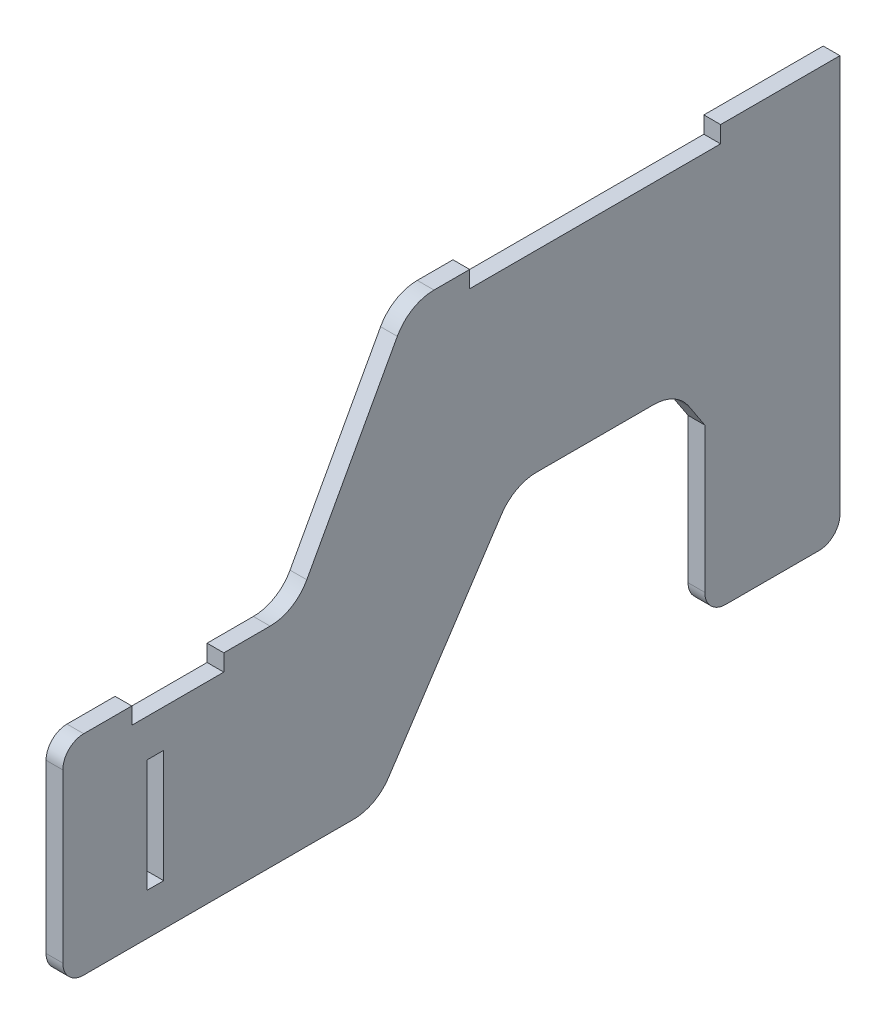
ISO-10303-21;
HEADER;
FILE_DESCRIPTION(('STEP AP214'),'2;1');
FILE_NAME('part.step','',(''),(''),'','','');
FILE_SCHEMA(('AUTOMOTIVE_DESIGN { 1 0 10303 214 1 1 1 1 }'));
ENDSEC;
DATA;
#1=APPLICATION_CONTEXT('core data for automotive mechanical design processes');
#2=APPLICATION_PROTOCOL_DEFINITION('international standard','automotive_design',2000,#1);
#3=PRODUCT_CONTEXT('',#1,'mechanical');
#4=PRODUCT('Part','Part','',(#3));
#5=PRODUCT_RELATED_PRODUCT_CATEGORY('part','',(#4));
#6=PRODUCT_DEFINITION_FORMATION('','',#4);
#7=PRODUCT_DEFINITION_CONTEXT('part definition',#1,'design');
#8=PRODUCT_DEFINITION('design','',#6,#7);
#9=PRODUCT_DEFINITION_SHAPE('','',#8);
#10=(LENGTH_UNIT() NAMED_UNIT(*) SI_UNIT(.MILLI.,.METRE.));
#11=(NAMED_UNIT(*) PLANE_ANGLE_UNIT() SI_UNIT($,.RADIAN.));
#12=(NAMED_UNIT(*) SI_UNIT($,.STERADIAN.) SOLID_ANGLE_UNIT());
#13=UNCERTAINTY_MEASURE_WITH_UNIT(LENGTH_MEASURE(1.E-05),#10,'distance_accuracy_value','');
#14=(GEOMETRIC_REPRESENTATION_CONTEXT(3) GLOBAL_UNCERTAINTY_ASSIGNED_CONTEXT((#13)) GLOBAL_UNIT_ASSIGNED_CONTEXT((#10,
#11,#12)) REPRESENTATION_CONTEXT('',''));
#15=CARTESIAN_POINT('',(0.,0.,0.));
#16=DIRECTION('',(0.,0.,1.));
#17=DIRECTION('',(1.,0.,0.));
#18=AXIS2_PLACEMENT_3D('',#15,#16,#17);
#19=CARTESIAN_POINT('',(4.,-136.204042198668,-171.684730912412));
#20=DIRECTION('',(0.,0.55017201591619,-0.835051347464762));
#21=DIRECTION('',(0.,0.835051347464762,0.55017201591619));
#22=AXIS2_PLACEMENT_3D('',#19,#20,#21);
#23=PLANE('',#22);
#24=DIRECTION('',(-1.,0.,0.));
#25=VECTOR('',#24,1.);
#26=CARTESIAN_POINT('',(4.,-101.052198369376,-148.525004457927));
#27=LINE('',#26,#25);
#28=CARTESIAN_POINT('',(4.,-101.052198369376,-148.525004457927));
#29=VERTEX_POINT('',#28);
#30=CARTESIAN_POINT('',(0.,-101.052198369376,-148.525004457927));
#31=VERTEX_POINT('',#30);
#32=EDGE_CURVE('E263',#29,#31,#27,.T.);
#33=ORIENTED_EDGE('',*,*,#32,.F.);
#34=DIRECTION('',(0.,-0.835051347464762,-0.55017201591619));
#35=VECTOR('',#34,1.);
#36=CARTESIAN_POINT('',(4.,-136.204042198668,-171.684730912412));
#37=LINE('',#36,#35);
#38=CARTESIAN_POINT('',(4.,-95.2006018803445,-144.66969107334));
#39=VERTEX_POINT('',#38);
#40=EDGE_CURVE('E277',#39,#29,#37,.T.);
#41=ORIENTED_EDGE('',*,*,#40,.F.);
#42=DIRECTION('',(-1.,0.,0.));
#43=VECTOR('',#42,1.);
#44=CARTESIAN_POINT('',(4.,-95.2006018803445,-144.66969107334));
#45=LINE('',#44,#43);
#46=CARTESIAN_POINT('',(0.,-95.2006018803445,-144.66969107334));
#47=VERTEX_POINT('',#46);
#48=EDGE_CURVE('E402',#39,#47,#45,.T.);
#49=ORIENTED_EDGE('',*,*,#48,.T.);
#50=DIRECTION('',(0.,-0.835051347464762,-0.55017201591619));
#51=VECTOR('',#50,1.);
#52=CARTESIAN_POINT('',(0.,-136.204042198668,-171.684730912412));
#53=LINE('',#52,#51);
#54=EDGE_CURVE('E279',#47,#31,#53,.T.);
#55=ORIENTED_EDGE('',*,*,#54,.T.);
#56=EDGE_LOOP('',(#33,#41,#49,#55));
#57=FACE_BOUND('',#56,.T.);
#58=ADVANCED_FACE('F48',(#57),#23,.F.);
#59=CARTESIAN_POINT('',(4.,-50.7023220395064,-83.7618124476445));
#60=DIRECTION('',(-1.,0.,0.));
#61=DIRECTION('',(0.,0.,1.));
#62=AXIS2_PLACEMENT_3D('',#59,#60,#61);
#63=PLANE('',#62);
#64=DIRECTION('',(0.,1.,0.));
#65=VECTOR('',#64,1.);
#66=CARTESIAN_POINT('',(4.,-40.7023220395064,-180.831194294369));
#67=LINE('',#66,#65);
#68=CARTESIAN_POINT('',(4.,-135.702322039506,-180.831194294369));
#69=VERTEX_POINT('',#68);
#70=CARTESIAN_POINT('',(4.,-40.7023220395064,-180.831194294369));
#71=VERTEX_POINT('',#70);
#72=EDGE_CURVE('E543',#69,#71,#67,.T.);
#73=ORIENTED_EDGE('',*,*,#72,.T.);
#74=DIRECTION('',(0.,0.,1.));
#75=VECTOR('',#74,1.);
#76=CARTESIAN_POINT('',(4.,-40.7023220395064,-152.296503371007));
#77=LINE('',#76,#75);
#78=CARTESIAN_POINT('',(4.,-40.7023220395064,-152.296503371007));
#79=VERTEX_POINT('',#78);
#80=EDGE_CURVE('E289',#71,#79,#77,.T.);
#81=ORIENTED_EDGE('',*,*,#80,.T.);
#82=DIRECTION('',(0.,-1.,0.));
#83=VECTOR('',#82,1.);
#84=CARTESIAN_POINT('',(4.,-40.7023220395064,-152.296503371007));
#85=LINE('',#84,#83);
#86=CARTESIAN_POINT('',(4.,-44.7023220395064,-152.296503371007));
#87=VERTEX_POINT('',#86);
#88=EDGE_CURVE('E293',#79,#87,#85,.T.);
#89=ORIENTED_EDGE('',*,*,#88,.T.);
#90=DIRECTION('',(0.,0.,1.));
#91=VECTOR('',#90,1.);
#92=CARTESIAN_POINT('',(4.,-44.7023220395064,-92.2965033710069));
#93=LINE('',#92,#91);
#94=CARTESIAN_POINT('',(4.,-44.7023220395064,-92.2965033710069));
#95=VERTEX_POINT('',#94);
#96=EDGE_CURVE('E301',#87,#95,#93,.T.);
#97=ORIENTED_EDGE('',*,*,#96,.T.);
#98=DIRECTION('',(0.,1.,0.));
#99=VECTOR('',#98,1.);
#100=CARTESIAN_POINT('',(4.,-40.7023220395064,-92.2965033710069));
#101=LINE('',#100,#99);
#102=CARTESIAN_POINT('',(4.,-40.7023220395064,-92.2965033710069));
#103=VERTEX_POINT('',#102);
#104=EDGE_CURVE('E304',#95,#103,#101,.T.);
#105=ORIENTED_EDGE('',*,*,#104,.T.);
#106=DIRECTION('',(0.,0.,1.));
#107=VECTOR('',#106,1.);
#108=CARTESIAN_POINT('',(4.,-40.7023220395064,-83.7618124476445));
#109=LINE('',#108,#107);
#110=CARTESIAN_POINT('',(4.,-40.7023220395064,-83.7618124476445));
#111=VERTEX_POINT('',#110);
#112=EDGE_CURVE('E307',#103,#111,#109,.T.);
#113=ORIENTED_EDGE('',*,*,#112,.T.);
#114=CARTESIAN_POINT('',(4.,-50.7023220395064,-83.7618124476445));
#115=DIRECTION('',(1.,0.,0.));
#116=DIRECTION('',(0.,0.,1.));
#117=AXIS2_PLACEMENT_3D('',#114,#115,#116);
#118=CIRCLE('',#117,10.);
#119=CARTESIAN_POINT('',(4.,-45.9058680357739,-74.9871882967148));
#120=VERTEX_POINT('',#119);
#121=EDGE_CURVE('E382',#111,#120,#118,.T.);
#122=ORIENTED_EDGE('',*,*,#121,.T.);
#123=DIRECTION('',(0.,-0.877462415092971,0.479645400373245));
#124=VECTOR('',#123,1.);
#125=CARTESIAN_POINT('',(4.,-85.4987760432388,-53.344601803515));
#126=LINE('',#125,#124);
#127=CARTESIAN_POINT('',(4.,-85.4987760432388,-53.344601803515));
#128=VERTEX_POINT('',#127);
#129=EDGE_CURVE('E611',#120,#128,#126,.T.);
#130=ORIENTED_EDGE('',*,*,#129,.T.);
#131=CARTESIAN_POINT('',(4.,-80.7023220395064,-44.5699776525853));
#132=DIRECTION('',(-1.,0.,0.));
#133=DIRECTION('',(0.,0.,-1.));
#134=AXIS2_PLACEMENT_3D('',#131,#132,#133);
#135=CIRCLE('',#134,10.);
#136=CARTESIAN_POINT('',(4.,-90.7023220395064,-44.5699776525853));
#137=VERTEX_POINT('',#136);
#138=EDGE_CURVE('E468',#128,#137,#135,.T.);
#139=ORIENTED_EDGE('',*,*,#138,.T.);
#140=DIRECTION('',(0.,0.,1.));
#141=VECTOR('',#140,1.);
#142=CARTESIAN_POINT('',(4.,-90.7023220395064,-38.5350881272695));
#143=LINE('',#142,#141);
#144=CARTESIAN_POINT('',(4.,-90.7023220395064,-33.5001986019536));
#145=VERTEX_POINT('',#144);
#146=EDGE_CURVE('E488',#137,#145,#143,.T.);
#147=ORIENTED_EDGE('',*,*,#146,.T.);
#148=DIRECTION('',(0.,-1.,0.));
#149=VECTOR('',#148,1.);
#150=CARTESIAN_POINT('',(4.,-94.7023220395064,-33.5001986019536));
#151=LINE('',#150,#149);
#152=CARTESIAN_POINT('',(4.,-94.7023220395064,-33.5001986019536));
#153=VERTEX_POINT('',#152);
#154=EDGE_CURVE('E484',#145,#153,#151,.T.);
#155=ORIENTED_EDGE('',*,*,#154,.T.);
#156=DIRECTION('',(0.,0.,1.));
#157=VECTOR('',#156,1.);
#158=CARTESIAN_POINT('',(4.,-94.7023220395064,-11.5001986019536));
#159=LINE('',#158,#157);
#160=CARTESIAN_POINT('',(4.,-94.7023220395064,-11.5001986019536));
#161=VERTEX_POINT('',#160);
#162=EDGE_CURVE('E487',#153,#161,#159,.T.);
#163=ORIENTED_EDGE('',*,*,#162,.T.);
#164=DIRECTION('',(0.,1.,0.));
#165=VECTOR('',#164,1.);
#166=CARTESIAN_POINT('',(4.,-90.7023220395064,-11.5001986019536));
#167=LINE('',#166,#165);
#168=CARTESIAN_POINT('',(4.,-90.7023220395064,-11.5001986019536));
#169=VERTEX_POINT('',#168);
#170=EDGE_CURVE('E492',#161,#169,#167,.T.);
#171=ORIENTED_EDGE('',*,*,#170,.T.);
#172=DIRECTION('',(0.,0.,1.));
#173=VECTOR('',#172,1.);
#174=CARTESIAN_POINT('',(4.,-90.7023220395064,0.));
#175=LINE('',#174,#173);
#176=CARTESIAN_POINT('',(4.,-90.7023220395064,0.));
#177=VERTEX_POINT('',#176);
#178=EDGE_CURVE('E499',#169,#177,#175,.T.);
#179=ORIENTED_EDGE('',*,*,#178,.T.);
#180=CARTESIAN_POINT('',(4.,-95.7023220395064,0.));
#181=DIRECTION('',(1.,0.,0.));
#182=DIRECTION('',(0.,0.,1.));
#183=AXIS2_PLACEMENT_3D('',#180,#181,#182);
#184=CIRCLE('',#183,5.);
#185=CARTESIAN_POINT('',(4.,-95.7023220395064,5.));
#186=VERTEX_POINT('',#185);
#187=EDGE_CURVE('E502',#177,#186,#184,.T.);
#188=ORIENTED_EDGE('',*,*,#187,.T.);
#189=DIRECTION('',(0.,-1.,0.));
#190=VECTOR('',#189,1.);
#191=CARTESIAN_POINT('',(4.,-95.7023220395064,5.));
#192=LINE('',#191,#190);
#193=CARTESIAN_POINT('',(4.,-135.702322039506,5.));
#194=VERTEX_POINT('',#193);
#195=EDGE_CURVE('E505',#186,#194,#192,.T.);
#196=ORIENTED_EDGE('',*,*,#195,.T.);
#197=CARTESIAN_POINT('',(4.,-135.702322039506,0.));
#198=DIRECTION('',(1.,0.,0.));
#199=DIRECTION('',(0.,0.,-1.));
#200=AXIS2_PLACEMENT_3D('',#197,#198,#199);
#201=CIRCLE('',#200,5.);
#202=CARTESIAN_POINT('',(4.,-140.702322039506,0.));
#203=VERTEX_POINT('',#202);
#204=EDGE_CURVE('E508',#194,#203,#201,.T.);
#205=ORIENTED_EDGE('',*,*,#204,.T.);
#206=DIRECTION('',(0.,0.,-1.));
#207=VECTOR('',#206,1.);
#208=CARTESIAN_POINT('',(4.,-140.702322039506,0.));
#209=LINE('',#208,#207);
#210=CARTESIAN_POINT('',(4.,-140.702322039506,-64.5577623549545));
#211=VERTEX_POINT('',#210);
#212=EDGE_CURVE('E511',#203,#211,#209,.T.);
#213=ORIENTED_EDGE('',*,*,#212,.T.);
#214=CARTESIAN_POINT('',(4.,-130.702322039506,-64.5577623549545));
#215=DIRECTION('',(1.,0.,0.));
#216=DIRECTION('',(0.,0.,1.));
#217=AXIS2_PLACEMENT_3D('',#214,#215,#216);
#218=CIRCLE('',#217,10.);
#219=CARTESIAN_POINT('',(4.,-136.204042198668,-72.9082758296021));
#220=VERTEX_POINT('',#219);
#221=EDGE_CURVE('E514',#211,#220,#218,.T.);
#222=ORIENTED_EDGE('',*,*,#221,.T.);
#223=DIRECTION('',(0.,0.835051347464763,-0.55017201591619));
#224=VECTOR('',#223,1.);
#225=CARTESIAN_POINT('',(4.,-136.204042198668,-72.9082758296021));
#226=LINE('',#225,#224);
#227=CARTESIAN_POINT('',(4.,-95.2006018803445,-99.9233156686742));
#228=VERTEX_POINT('',#227);
#229=EDGE_CURVE('E517',#220,#228,#226,.T.);
#230=ORIENTED_EDGE('',*,*,#229,.T.);
#231=CARTESIAN_POINT('',(4.,-100.702322039506,-108.273829143322));
#232=DIRECTION('',(-1.,0.,0.));
#233=DIRECTION('',(0.,0.,1.));
#234=AXIS2_PLACEMENT_3D('',#231,#232,#233);
#235=CIRCLE('',#234,10.);
#236=CARTESIAN_POINT('',(4.,-90.7023220395064,-108.273829143322));
#237=VERTEX_POINT('',#236);
#238=EDGE_CURVE('E520',#228,#237,#235,.T.);
#239=ORIENTED_EDGE('',*,*,#238,.T.);
#240=DIRECTION('',(0.,0.,-1.));
#241=VECTOR('',#240,1.);
#242=CARTESIAN_POINT('',(4.,-90.7023220395064,-136.319177598692));
#243=LINE('',#242,#241);
#244=CARTESIAN_POINT('',(4.,-90.7023220395064,-136.319177598692));
#245=VERTEX_POINT('',#244);
#246=EDGE_CURVE('E295',#237,#245,#243,.T.);
#247=ORIENTED_EDGE('',*,*,#246,.T.);
#248=CARTESIAN_POINT('',(4.,-100.702322039506,-136.319177598692));
#249=DIRECTION('',(-1.,0.,0.));
#250=DIRECTION('',(0.,0.,-1.));
#251=AXIS2_PLACEMENT_3D('',#248,#249,#250);
#252=CIRCLE('',#251,10.);
#253=EDGE_CURVE('E286',#245,#39,#252,.T.);
#254=ORIENTED_EDGE('',*,*,#253,.T.);
#255=ORIENTED_EDGE('',*,*,#40,.T.);
#256=DIRECTION('',(0.,-1.,0.));
#257=VECTOR('',#256,1.);
#258=CARTESIAN_POINT('',(4.,-101.052198369376,-148.525004457927));
#259=LINE('',#258,#257);
#260=CARTESIAN_POINT('',(4.,-135.702322039506,-148.525004457927));
#261=VERTEX_POINT('',#260);
#262=EDGE_CURVE('E260',#29,#261,#259,.T.);
#263=ORIENTED_EDGE('',*,*,#262,.T.);
#264=CARTESIAN_POINT('',(4.,-135.702322039506,-153.525004457927));
#265=DIRECTION('',(1.,0.,0.));
#266=DIRECTION('',(0.,0.,-1.));
#267=AXIS2_PLACEMENT_3D('',#264,#265,#266);
#268=CIRCLE('',#267,5.);
#269=CARTESIAN_POINT('',(4.,-140.702322039506,-153.525004457927));
#270=VERTEX_POINT('',#269);
#271=EDGE_CURVE('E271',#261,#270,#268,.T.);
#272=ORIENTED_EDGE('',*,*,#271,.T.);
#273=DIRECTION('',(0.,0.,-1.));
#274=VECTOR('',#273,1.);
#275=CARTESIAN_POINT('',(4.,-140.702322039506,-153.525004457927));
#276=LINE('',#275,#274);
#277=CARTESIAN_POINT('',(4.,-140.702322039506,-175.831194294369));
#278=VERTEX_POINT('',#277);
#279=EDGE_CURVE('E656',#270,#278,#276,.T.);
#280=ORIENTED_EDGE('',*,*,#279,.T.);
#281=CARTESIAN_POINT('',(4.,-135.702322039506,-175.831194294369));
#282=DIRECTION('',(1.,0.,0.));
#283=DIRECTION('',(0.,0.,-1.));
#284=AXIS2_PLACEMENT_3D('',#281,#282,#283);
#285=CIRCLE('',#284,5.);
#286=EDGE_CURVE('E652',#278,#69,#285,.T.);
#287=ORIENTED_EDGE('',*,*,#286,.T.);
#288=EDGE_LOOP('',(#73,#81,#89,#97,#105,#113,#122,#130,#139,#147,#155,#163,#171,#179,#188,#196,
#205,#213,#222,#230,#239,#247,#254,#255,#263,#272,#280,#287));
#289=FACE_BOUND('',#288,.T.);
#290=DIRECTION('',(0.,1.,0.));
#291=VECTOR('',#290,1.);
#292=CARTESIAN_POINT('',(4.,-103.702322039506,-19.13));
#293=LINE('',#292,#291);
#294=CARTESIAN_POINT('',(4.,-130.702322039506,-19.13));
#295=VERTEX_POINT('',#294);
#296=CARTESIAN_POINT('',(4.,-103.702322039506,-19.13));
#297=VERTEX_POINT('',#296);
#298=EDGE_CURVE('E572',#295,#297,#293,.T.);
#299=ORIENTED_EDGE('',*,*,#298,.F.);
#300=DIRECTION('',(0.,0.,-1.));
#301=VECTOR('',#300,1.);
#302=CARTESIAN_POINT('',(4.,-130.702322039506,-19.13));
#303=LINE('',#302,#301);
#304=CARTESIAN_POINT('',(4.,-130.702322039506,-15.13));
#305=VERTEX_POINT('',#304);
#306=EDGE_CURVE('E582',#305,#295,#303,.T.);
#307=ORIENTED_EDGE('',*,*,#306,.F.);
#308=DIRECTION('',(0.,-1.,0.));
#309=VECTOR('',#308,1.);
#310=CARTESIAN_POINT('',(4.,-103.702322039506,-15.13));
#311=LINE('',#310,#309);
#312=CARTESIAN_POINT('',(4.,-103.702322039506,-15.13));
#313=VERTEX_POINT('',#312);
#314=EDGE_CURVE('E579',#313,#305,#311,.T.);
#315=ORIENTED_EDGE('',*,*,#314,.F.);
#316=DIRECTION('',(0.,0.,1.));
#317=VECTOR('',#316,1.);
#318=CARTESIAN_POINT('',(4.,-103.702322039506,-19.13));
#319=LINE('',#318,#317);
#320=EDGE_CURVE('E575',#297,#313,#319,.T.);
#321=ORIENTED_EDGE('',*,*,#320,.F.);
#322=EDGE_LOOP('',(#299,#307,#315,#321));
#323=FACE_BOUND('',#322,.T.);
#324=ADVANCED_FACE('F283',(#289,#323),#63,.F.);
#325=CARTESIAN_POINT('',(0.,-50.7023220395064,-83.7618124476445));
#326=DIRECTION('',(-1.,0.,0.));
#327=DIRECTION('',(0.,0.,1.));
#328=AXIS2_PLACEMENT_3D('',#325,#326,#327);
#329=PLANE('',#328);
#330=DIRECTION('',(0.,-1.,0.));
#331=VECTOR('',#330,1.);
#332=CARTESIAN_POINT('',(0.,-101.052198369376,-148.525004457927));
#333=LINE('',#332,#331);
#334=CARTESIAN_POINT('',(0.,-135.702322039506,-148.525004457927));
#335=VERTEX_POINT('',#334);
#336=EDGE_CURVE('E534',#31,#335,#333,.T.);
#337=ORIENTED_EDGE('',*,*,#336,.F.);
#338=ORIENTED_EDGE('',*,*,#54,.F.);
#339=CARTESIAN_POINT('',(0.,-100.702322039506,-136.319177598692));
#340=DIRECTION('',(-1.,0.,0.));
#341=DIRECTION('',(0.,0.,-1.));
#342=AXIS2_PLACEMENT_3D('',#339,#340,#341);
#343=CIRCLE('',#342,10.);
#344=CARTESIAN_POINT('',(0.,-90.7023220395064,-136.319177598692));
#345=VERTEX_POINT('',#344);
#346=EDGE_CURVE('E362',#345,#47,#343,.T.);
#347=ORIENTED_EDGE('',*,*,#346,.F.);
#348=DIRECTION('',(0.,0.,-1.));
#349=VECTOR('',#348,1.);
#350=CARTESIAN_POINT('',(0.,-90.7023220395064,-136.319177598692));
#351=LINE('',#350,#349);
#352=CARTESIAN_POINT('',(0.,-90.7023220395064,-108.273829143322));
#353=VERTEX_POINT('',#352);
#354=EDGE_CURVE('E359',#353,#345,#351,.T.);
#355=ORIENTED_EDGE('',*,*,#354,.F.);
#356=CARTESIAN_POINT('',(0.,-100.702322039506,-108.273829143322));
#357=DIRECTION('',(-1.,0.,0.));
#358=DIRECTION('',(0.,0.,1.));
#359=AXIS2_PLACEMENT_3D('',#356,#357,#358);
#360=CIRCLE('',#359,10.);
#361=CARTESIAN_POINT('',(0.,-95.2006018803445,-99.9233156686742));
#362=VERTEX_POINT('',#361);
#363=EDGE_CURVE('E356',#362,#353,#360,.T.);
#364=ORIENTED_EDGE('',*,*,#363,.F.);
#365=DIRECTION('',(0.,0.835051347464763,-0.55017201591619));
#366=VECTOR('',#365,1.);
#367=CARTESIAN_POINT('',(0.,-136.204042198668,-72.9082758296021));
#368=LINE('',#367,#366);
#369=CARTESIAN_POINT('',(0.,-136.204042198668,-72.9082758296021));
#370=VERTEX_POINT('',#369);
#371=EDGE_CURVE('E353',#370,#362,#368,.T.);
#372=ORIENTED_EDGE('',*,*,#371,.F.);
#373=CARTESIAN_POINT('',(0.,-130.702322039506,-64.5577623549545));
#374=DIRECTION('',(1.,0.,0.));
#375=DIRECTION('',(0.,0.,1.));
#376=AXIS2_PLACEMENT_3D('',#373,#374,#375);
#377=CIRCLE('',#376,10.);
#378=CARTESIAN_POINT('',(0.,-140.702322039506,-64.5577623549545));
#379=VERTEX_POINT('',#378);
#380=EDGE_CURVE('E350',#379,#370,#377,.T.);
#381=ORIENTED_EDGE('',*,*,#380,.F.);
#382=DIRECTION('',(0.,0.,-1.));
#383=VECTOR('',#382,1.);
#384=CARTESIAN_POINT('',(0.,-140.702322039506,0.));
#385=LINE('',#384,#383);
#386=CARTESIAN_POINT('',(0.,-140.702322039506,0.));
#387=VERTEX_POINT('',#386);
#388=EDGE_CURVE('E347',#387,#379,#385,.T.);
#389=ORIENTED_EDGE('',*,*,#388,.F.);
#390=CARTESIAN_POINT('',(0.,-135.702322039506,0.));
#391=DIRECTION('',(1.,0.,0.));
#392=DIRECTION('',(0.,0.,-1.));
#393=AXIS2_PLACEMENT_3D('',#390,#391,#392);
#394=CIRCLE('',#393,5.);
#395=CARTESIAN_POINT('',(0.,-135.702322039506,5.));
#396=VERTEX_POINT('',#395);
#397=EDGE_CURVE('E344',#396,#387,#394,.T.);
#398=ORIENTED_EDGE('',*,*,#397,.F.);
#399=DIRECTION('',(0.,-1.,0.));
#400=VECTOR('',#399,1.);
#401=CARTESIAN_POINT('',(0.,-95.7023220395064,5.));
#402=LINE('',#401,#400);
#403=CARTESIAN_POINT('',(0.,-95.7023220395064,5.));
#404=VERTEX_POINT('',#403);
#405=EDGE_CURVE('E341',#404,#396,#402,.T.);
#406=ORIENTED_EDGE('',*,*,#405,.F.);
#407=CARTESIAN_POINT('',(0.,-95.7023220395064,0.));
#408=DIRECTION('',(1.,0.,0.));
#409=DIRECTION('',(0.,0.,1.));
#410=AXIS2_PLACEMENT_3D('',#407,#408,#409);
#411=CIRCLE('',#410,5.);
#412=CARTESIAN_POINT('',(0.,-90.7023220395064,0.));
#413=VERTEX_POINT('',#412);
#414=EDGE_CURVE('E338',#413,#404,#411,.T.);
#415=ORIENTED_EDGE('',*,*,#414,.F.);
#416=DIRECTION('',(0.,0.,1.));
#417=VECTOR('',#416,1.);
#418=CARTESIAN_POINT('',(0.,-90.7023220395064,0.));
#419=LINE('',#418,#417);
#420=CARTESIAN_POINT('',(0.,-90.7023220395064,-11.5001986019536));
#421=VERTEX_POINT('',#420);
#422=EDGE_CURVE('E335',#421,#413,#419,.T.);
#423=ORIENTED_EDGE('',*,*,#422,.F.);
#424=DIRECTION('',(0.,1.,0.));
#425=VECTOR('',#424,1.);
#426=CARTESIAN_POINT('',(0.,-90.7023220395064,-11.5001986019536));
#427=LINE('',#426,#425);
#428=CARTESIAN_POINT('',(0.,-94.7023220395064,-11.5001986019536));
#429=VERTEX_POINT('',#428);
#430=EDGE_CURVE('E332',#429,#421,#427,.T.);
#431=ORIENTED_EDGE('',*,*,#430,.F.);
#432=DIRECTION('',(0.,0.,1.));
#433=VECTOR('',#432,1.);
#434=CARTESIAN_POINT('',(0.,-94.7023220395064,-11.5001986019536));
#435=LINE('',#434,#433);
#436=CARTESIAN_POINT('',(0.,-94.7023220395064,-33.5001986019536));
#437=VERTEX_POINT('',#436);
#438=EDGE_CURVE('E329',#437,#429,#435,.T.);
#439=ORIENTED_EDGE('',*,*,#438,.F.);
#440=DIRECTION('',(0.,-1.,0.));
#441=VECTOR('',#440,1.);
#442=CARTESIAN_POINT('',(0.,-94.7023220395064,-33.5001986019536));
#443=LINE('',#442,#441);
#444=CARTESIAN_POINT('',(0.,-90.7023220395064,-33.5001986019536));
#445=VERTEX_POINT('',#444);
#446=EDGE_CURVE('E326',#445,#437,#443,.T.);
#447=ORIENTED_EDGE('',*,*,#446,.F.);
#448=DIRECTION('',(0.,0.,1.));
#449=VECTOR('',#448,1.);
#450=CARTESIAN_POINT('',(0.,-90.7023220395064,-33.5001986019536));
#451=LINE('',#450,#449);
#452=CARTESIAN_POINT('',(0.,-90.7023220395064,-44.5699776525853));
#453=VERTEX_POINT('',#452);
#454=EDGE_CURVE('E323',#453,#445,#451,.T.);
#455=ORIENTED_EDGE('',*,*,#454,.F.);
#456=CARTESIAN_POINT('',(0.,-80.7023220395064,-44.5699776525853));
#457=DIRECTION('',(-1.,0.,0.));
#458=DIRECTION('',(0.,0.,-1.));
#459=AXIS2_PLACEMENT_3D('',#456,#457,#458);
#460=CIRCLE('',#459,10.);
#461=CARTESIAN_POINT('',(0.,-85.4987760432388,-53.344601803515));
#462=VERTEX_POINT('',#461);
#463=EDGE_CURVE('E319',#462,#453,#460,.T.);
#464=ORIENTED_EDGE('',*,*,#463,.F.);
#465=DIRECTION('',(0.,-0.877462415092971,0.479645400373245));
#466=VECTOR('',#465,1.);
#467=CARTESIAN_POINT('',(0.,-85.4987760432388,-53.344601803515));
#468=LINE('',#467,#466);
#469=CARTESIAN_POINT('',(0.,-45.9058680357739,-74.9871882967148));
#470=VERTEX_POINT('',#469);
#471=EDGE_CURVE('E315',#470,#462,#468,.T.);
#472=ORIENTED_EDGE('',*,*,#471,.F.);
#473=CARTESIAN_POINT('',(0.,-50.7023220395064,-83.7618124476445));
#474=DIRECTION('',(1.,0.,0.));
#475=DIRECTION('',(0.,0.,1.));
#476=AXIS2_PLACEMENT_3D('',#473,#474,#475);
#477=CIRCLE('',#476,10.);
#478=CARTESIAN_POINT('',(0.,-40.7023220395064,-83.7618124476445));
#479=VERTEX_POINT('',#478);
#480=EDGE_CURVE('E311',#479,#470,#477,.T.);
#481=ORIENTED_EDGE('',*,*,#480,.F.);
#482=DIRECTION('',(0.,0.,1.));
#483=VECTOR('',#482,1.);
#484=CARTESIAN_POINT('',(0.,-40.7023220395064,-83.7618124476445));
#485=LINE('',#484,#483);
#486=CARTESIAN_POINT('',(0.,-40.7023220395064,-92.2965033710069));
#487=VERTEX_POINT('',#486);
#488=EDGE_CURVE('E379',#487,#479,#485,.T.);
#489=ORIENTED_EDGE('',*,*,#488,.F.);
#490=DIRECTION('',(0.,1.,0.));
#491=VECTOR('',#490,1.);
#492=CARTESIAN_POINT('',(0.,-40.7023220395064,-92.2965033710069));
#493=LINE('',#492,#491);
#494=CARTESIAN_POINT('',(0.,-44.7023220395064,-92.2965033710069));
#495=VERTEX_POINT('',#494);
#496=EDGE_CURVE('E376',#495,#487,#493,.T.);
#497=ORIENTED_EDGE('',*,*,#496,.F.);
#498=DIRECTION('',(0.,0.,1.));
#499=VECTOR('',#498,1.);
#500=CARTESIAN_POINT('',(0.,-44.7023220395064,-92.2965033710069));
#501=LINE('',#500,#499);
#502=CARTESIAN_POINT('',(0.,-44.7023220395064,-152.296503371007));
#503=VERTEX_POINT('',#502);
#504=EDGE_CURVE('E373',#503,#495,#501,.T.);
#505=ORIENTED_EDGE('',*,*,#504,.F.);
#506=DIRECTION('',(0.,-1.,0.));
#507=VECTOR('',#506,1.);
#508=CARTESIAN_POINT('',(0.,-40.7023220395064,-152.296503371007));
#509=LINE('',#508,#507);
#510=CARTESIAN_POINT('',(0.,-40.7023220395064,-152.296503371007));
#511=VERTEX_POINT('',#510);
#512=EDGE_CURVE('E370',#511,#503,#509,.T.);
#513=ORIENTED_EDGE('',*,*,#512,.F.);
#514=DIRECTION('',(0.,0.,1.));
#515=VECTOR('',#514,1.);
#516=CARTESIAN_POINT('',(0.,-40.7023220395064,-152.296503371007));
#517=LINE('',#516,#515);
#518=CARTESIAN_POINT('',(0.,-40.7023220395064,-180.831194294369));
#519=VERTEX_POINT('',#518);
#520=EDGE_CURVE('E367',#519,#511,#517,.T.);
#521=ORIENTED_EDGE('',*,*,#520,.F.);
#522=DIRECTION('',(0.,1.,0.));
#523=VECTOR('',#522,1.);
#524=CARTESIAN_POINT('',(0.,-40.7023220395064,-180.831194294369));
#525=LINE('',#524,#523);
#526=CARTESIAN_POINT('',(0.,-135.702322039506,-180.831194294369));
#527=VERTEX_POINT('',#526);
#528=EDGE_CURVE('E272',#527,#519,#525,.T.);
#529=ORIENTED_EDGE('',*,*,#528,.F.);
#530=CARTESIAN_POINT('',(0.,-135.702322039506,-175.831194294369));
#531=DIRECTION('',(1.,0.,0.));
#532=DIRECTION('',(0.,0.,-1.));
#533=AXIS2_PLACEMENT_3D('',#530,#531,#532);
#534=CIRCLE('',#533,5.);
#535=CARTESIAN_POINT('',(0.,-140.702322039506,-175.831194294369));
#536=VERTEX_POINT('',#535);
#537=EDGE_CURVE('E548',#536,#527,#534,.T.);
#538=ORIENTED_EDGE('',*,*,#537,.F.);
#539=DIRECTION('',(0.,0.,-1.));
#540=VECTOR('',#539,1.);
#541=CARTESIAN_POINT('',(0.,-140.702322039506,-153.525004457927));
#542=LINE('',#541,#540);
#543=CARTESIAN_POINT('',(0.,-140.702322039506,-153.525004457927));
#544=VERTEX_POINT('',#543);
#545=EDGE_CURVE('E540',#544,#536,#542,.T.);
#546=ORIENTED_EDGE('',*,*,#545,.F.);
#547=CARTESIAN_POINT('',(0.,-135.702322039506,-153.525004457927));
#548=DIRECTION('',(1.,0.,0.));
#549=DIRECTION('',(0.,0.,-1.));
#550=AXIS2_PLACEMENT_3D('',#547,#548,#549);
#551=CIRCLE('',#550,5.);
#552=EDGE_CURVE('E536',#335,#544,#551,.T.);
#553=ORIENTED_EDGE('',*,*,#552,.F.);
#554=EDGE_LOOP('',(#337,#338,#347,#355,#364,#372,#381,#389,#398,#406,#415,#423,#431,#439,#447,
#455,#464,#472,#481,#489,#497,#505,#513,#521,#529,#538,#546,#553));
#555=FACE_BOUND('',#554,.T.);
#556=DIRECTION('',(0.,0.,-1.));
#557=VECTOR('',#556,1.);
#558=CARTESIAN_POINT('',(0.,-130.702322039506,-19.13));
#559=LINE('',#558,#557);
#560=CARTESIAN_POINT('',(0.,-130.702322039506,-15.13));
#561=VERTEX_POINT('',#560);
#562=CARTESIAN_POINT('',(0.,-130.702322039506,-19.13));
#563=VERTEX_POINT('',#562);
#564=EDGE_CURVE('E576',#561,#563,#559,.T.);
#565=ORIENTED_EDGE('',*,*,#564,.T.);
#566=DIRECTION('',(0.,1.,0.));
#567=VECTOR('',#566,1.);
#568=CARTESIAN_POINT('',(0.,-103.702322039506,-19.13));
#569=LINE('',#568,#567);
#570=CARTESIAN_POINT('',(0.,-103.702322039506,-19.13));
#571=VERTEX_POINT('',#570);
#572=EDGE_CURVE('E72',#563,#571,#569,.T.);
#573=ORIENTED_EDGE('',*,*,#572,.T.);
#574=DIRECTION('',(0.,0.,1.));
#575=VECTOR('',#574,1.);
#576=CARTESIAN_POINT('',(0.,-103.702322039506,-19.13));
#577=LINE('',#576,#575);
#578=CARTESIAN_POINT('',(0.,-103.702322039506,-15.13));
#579=VERTEX_POINT('',#578);
#580=EDGE_CURVE('E588',#571,#579,#577,.T.);
#581=ORIENTED_EDGE('',*,*,#580,.T.);
#582=DIRECTION('',(0.,-1.,0.));
#583=VECTOR('',#582,1.);
#584=CARTESIAN_POINT('',(0.,-103.702322039506,-15.13));
#585=LINE('',#584,#583);
#586=EDGE_CURVE('E592',#579,#561,#585,.T.);
#587=ORIENTED_EDGE('',*,*,#586,.T.);
#588=EDGE_LOOP('',(#565,#573,#581,#587));
#589=FACE_BOUND('',#588,.T.);
#590=ADVANCED_FACE('F471',(#555,#589),#329,.T.);
#591=CARTESIAN_POINT('',(4.,-50.7023220395064,-83.7618124476445));
#592=DIRECTION('',(-1.,0.,0.));
#593=DIRECTION('',(0.,0.,1.));
#594=AXIS2_PLACEMENT_3D('',#591,#592,#593);
#595=CYLINDRICAL_SURFACE('',#594,10.);
#596=ORIENTED_EDGE('',*,*,#480,.T.);
#597=DIRECTION('',(-1.,0.,0.));
#598=VECTOR('',#597,1.);
#599=CARTESIAN_POINT('',(4.,-45.9058680357739,-74.9871882967148));
#600=LINE('',#599,#598);
#601=EDGE_CURVE('E11',#120,#470,#600,.T.);
#602=ORIENTED_EDGE('',*,*,#601,.F.);
#603=ORIENTED_EDGE('',*,*,#121,.F.);
#604=DIRECTION('',(-1.,0.,0.));
#605=VECTOR('',#604,1.);
#606=CARTESIAN_POINT('',(4.,-40.7023220395064,-83.7618124476445));
#607=LINE('',#606,#605);
#608=EDGE_CURVE('E310',#111,#479,#607,.T.);
#609=ORIENTED_EDGE('',*,*,#608,.T.);
#610=EDGE_LOOP('',(#596,#602,#603,#609));
#611=FACE_BOUND('',#610,.T.);
#612=ADVANCED_FACE('F50',(#611),#595,.T.);
#613=CARTESIAN_POINT('',(4.,-85.4987760432388,-53.344601803515));
#614=DIRECTION('',(0.,-0.479645400373245,-0.877462415092971));
#615=DIRECTION('',(0.,0.877462415092971,-0.479645400373245));
#616=AXIS2_PLACEMENT_3D('',#613,#614,#615);
#617=PLANE('',#616);
#618=ORIENTED_EDGE('',*,*,#471,.T.);
#619=DIRECTION('',(-1.,0.,0.));
#620=VECTOR('',#619,1.);
#621=CARTESIAN_POINT('',(4.,-85.4987760432388,-53.344601803515));
#622=LINE('',#621,#620);
#623=EDGE_CURVE('E57',#128,#462,#622,.T.);
#624=ORIENTED_EDGE('',*,*,#623,.F.);
#625=ORIENTED_EDGE('',*,*,#129,.F.);
#626=ORIENTED_EDGE('',*,*,#601,.T.);
#627=EDGE_LOOP('',(#618,#624,#625,#626));
#628=FACE_BOUND('',#627,.T.);
#629=ADVANCED_FACE('F616',(#628),#617,.F.);
#630=CARTESIAN_POINT('',(4.,-80.7023220395064,-44.5699776525853));
#631=DIRECTION('',(-1.,0.,0.));
#632=DIRECTION('',(0.,0.,1.));
#633=AXIS2_PLACEMENT_3D('',#630,#631,#632);
#634=CYLINDRICAL_SURFACE('',#633,10.);
#635=ORIENTED_EDGE('',*,*,#463,.T.);
#636=DIRECTION('',(-1.,0.,0.));
#637=VECTOR('',#636,1.);
#638=CARTESIAN_POINT('',(4.,-90.7023220395064,-44.5699776525853));
#639=LINE('',#638,#637);
#640=EDGE_CURVE('E457',#137,#453,#639,.T.);
#641=ORIENTED_EDGE('',*,*,#640,.F.);
#642=ORIENTED_EDGE('',*,*,#138,.F.);
#643=ORIENTED_EDGE('',*,*,#623,.T.);
#644=EDGE_LOOP('',(#635,#641,#642,#643));
#645=FACE_BOUND('',#644,.T.);
#646=ADVANCED_FACE('F466',(#645),#634,.F.);
#647=CARTESIAN_POINT('',(4.,-90.7023220395064,-33.5001986019536));
#648=DIRECTION('',(0.,-1.,0.));
#649=DIRECTION('',(0.,0.,-1.));
#650=AXIS2_PLACEMENT_3D('',#647,#648,#649);
#651=PLANE('',#650);
#652=ORIENTED_EDGE('',*,*,#454,.T.);
#653=DIRECTION('',(-1.,0.,0.));
#654=VECTOR('',#653,1.);
#655=CARTESIAN_POINT('',(4.,-90.7023220395064,-33.5001986019536));
#656=LINE('',#655,#654);
#657=EDGE_CURVE('E453',#145,#445,#656,.T.);
#658=ORIENTED_EDGE('',*,*,#657,.F.);
#659=ORIENTED_EDGE('',*,*,#146,.F.);
#660=ORIENTED_EDGE('',*,*,#640,.T.);
#661=EDGE_LOOP('',(#652,#658,#659,#660));
#662=FACE_BOUND('',#661,.T.);
#663=ADVANCED_FACE('F478',(#662),#651,.F.);
#664=CARTESIAN_POINT('',(4.,-94.7023220395064,-33.5001986019536));
#665=DIRECTION('',(0.,0.,-1.));
#666=DIRECTION('',(-1.,0.,0.));
#667=AXIS2_PLACEMENT_3D('',#664,#665,#666);
#668=PLANE('',#667);
#669=ORIENTED_EDGE('',*,*,#446,.T.);
#670=DIRECTION('',(-1.,0.,0.));
#671=VECTOR('',#670,1.);
#672=CARTESIAN_POINT('',(4.,-94.7023220395064,-33.5001986019536));
#673=LINE('',#672,#671);
#674=EDGE_CURVE('E449',#153,#437,#673,.T.);
#675=ORIENTED_EDGE('',*,*,#674,.F.);
#676=ORIENTED_EDGE('',*,*,#154,.F.);
#677=ORIENTED_EDGE('',*,*,#657,.T.);
#678=EDGE_LOOP('',(#669,#675,#676,#677));
#679=FACE_BOUND('',#678,.T.);
#680=ADVANCED_FACE('F482',(#679),#668,.F.);
#681=CARTESIAN_POINT('',(4.,-94.7023220395064,-11.5001986019536));
#682=DIRECTION('',(0.,-1.,0.));
#683=DIRECTION('',(0.,0.,-1.));
#684=AXIS2_PLACEMENT_3D('',#681,#682,#683);
#685=PLANE('',#684);
#686=ORIENTED_EDGE('',*,*,#438,.T.);
#687=DIRECTION('',(-1.,0.,0.));
#688=VECTOR('',#687,1.);
#689=CARTESIAN_POINT('',(4.,-94.7023220395064,-11.5001986019536));
#690=LINE('',#689,#688);
#691=EDGE_CURVE('E445',#161,#429,#690,.T.);
#692=ORIENTED_EDGE('',*,*,#691,.F.);
#693=ORIENTED_EDGE('',*,*,#162,.F.);
#694=ORIENTED_EDGE('',*,*,#674,.T.);
#695=EDGE_LOOP('',(#686,#692,#693,#694));
#696=FACE_BOUND('',#695,.T.);
#697=ADVANCED_FACE('F723',(#696),#685,.F.);
#698=CARTESIAN_POINT('',(4.,-90.7023220395064,-11.5001986019536));
#699=DIRECTION('',(0.,0.,1.));
#700=DIRECTION('',(0.,-1.,0.));
#701=AXIS2_PLACEMENT_3D('',#698,#699,#700);
#702=PLANE('',#701);
#703=ORIENTED_EDGE('',*,*,#430,.T.);
#704=DIRECTION('',(-1.,0.,0.));
#705=VECTOR('',#704,1.);
#706=CARTESIAN_POINT('',(4.,-90.7023220395064,-11.5001986019536));
#707=LINE('',#706,#705);
#708=EDGE_CURVE('E441',#169,#421,#707,.T.);
#709=ORIENTED_EDGE('',*,*,#708,.F.);
#710=ORIENTED_EDGE('',*,*,#170,.F.);
#711=ORIENTED_EDGE('',*,*,#691,.T.);
#712=EDGE_LOOP('',(#703,#709,#710,#711));
#713=FACE_BOUND('',#712,.T.);
#714=ADVANCED_FACE('F719',(#713),#702,.F.);
#715=CARTESIAN_POINT('',(4.,-90.7023220395064,0.));
#716=DIRECTION('',(0.,-1.,0.));
#717=DIRECTION('',(0.,0.,-1.));
#718=AXIS2_PLACEMENT_3D('',#715,#716,#717);
#719=PLANE('',#718);
#720=ORIENTED_EDGE('',*,*,#422,.T.);
#721=DIRECTION('',(-1.,0.,0.));
#722=VECTOR('',#721,1.);
#723=CARTESIAN_POINT('',(4.,-90.7023220395064,0.));
#724=LINE('',#723,#722);
#725=EDGE_CURVE('E437',#177,#413,#724,.T.);
#726=ORIENTED_EDGE('',*,*,#725,.F.);
#727=ORIENTED_EDGE('',*,*,#178,.F.);
#728=ORIENTED_EDGE('',*,*,#708,.T.);
#729=EDGE_LOOP('',(#720,#726,#727,#728));
#730=FACE_BOUND('',#729,.T.);
#731=ADVANCED_FACE('F715',(#730),#719,.F.);
#732=CARTESIAN_POINT('',(4.,-95.7023220395064,0.));
#733=DIRECTION('',(-1.,0.,0.));
#734=DIRECTION('',(0.,0.,1.));
#735=AXIS2_PLACEMENT_3D('',#732,#733,#734);
#736=CYLINDRICAL_SURFACE('',#735,5.);
#737=ORIENTED_EDGE('',*,*,#414,.T.);
#738=DIRECTION('',(-1.,0.,0.));
#739=VECTOR('',#738,1.);
#740=CARTESIAN_POINT('',(4.,-95.7023220395064,5.));
#741=LINE('',#740,#739);
#742=EDGE_CURVE('E433',#186,#404,#741,.T.);
#743=ORIENTED_EDGE('',*,*,#742,.F.);
#744=ORIENTED_EDGE('',*,*,#187,.F.);
#745=ORIENTED_EDGE('',*,*,#725,.T.);
#746=EDGE_LOOP('',(#737,#743,#744,#745));
#747=FACE_BOUND('',#746,.T.);
#748=ADVANCED_FACE('F711',(#747),#736,.T.);
#749=CARTESIAN_POINT('',(4.,-95.7023220395064,5.));
#750=DIRECTION('',(0.,0.,-1.));
#751=DIRECTION('',(-1.,0.,0.));
#752=AXIS2_PLACEMENT_3D('',#749,#750,#751);
#753=PLANE('',#752);
#754=ORIENTED_EDGE('',*,*,#405,.T.);
#755=DIRECTION('',(-1.,0.,0.));
#756=VECTOR('',#755,1.);
#757=CARTESIAN_POINT('',(4.,-135.702322039506,5.));
#758=LINE('',#757,#756);
#759=EDGE_CURVE('E429',#194,#396,#758,.T.);
#760=ORIENTED_EDGE('',*,*,#759,.F.);
#761=ORIENTED_EDGE('',*,*,#195,.F.);
#762=ORIENTED_EDGE('',*,*,#742,.T.);
#763=EDGE_LOOP('',(#754,#760,#761,#762));
#764=FACE_BOUND('',#763,.T.);
#765=ADVANCED_FACE('F707',(#764),#753,.F.);
#766=CARTESIAN_POINT('',(4.,-135.702322039506,0.));
#767=DIRECTION('',(-1.,0.,0.));
#768=DIRECTION('',(0.,0.,1.));
#769=AXIS2_PLACEMENT_3D('',#766,#767,#768);
#770=CYLINDRICAL_SURFACE('',#769,5.);
#771=ORIENTED_EDGE('',*,*,#397,.T.);
#772=DIRECTION('',(-1.,0.,0.));
#773=VECTOR('',#772,1.);
#774=CARTESIAN_POINT('',(4.,-140.702322039506,0.));
#775=LINE('',#774,#773);
#776=EDGE_CURVE('E425',#203,#387,#775,.T.);
#777=ORIENTED_EDGE('',*,*,#776,.F.);
#778=ORIENTED_EDGE('',*,*,#204,.F.);
#779=ORIENTED_EDGE('',*,*,#759,.T.);
#780=EDGE_LOOP('',(#771,#777,#778,#779));
#781=FACE_BOUND('',#780,.T.);
#782=ADVANCED_FACE('F703',(#781),#770,.T.);
#783=CARTESIAN_POINT('',(4.,-140.702322039506,0.));
#784=DIRECTION('',(0.,1.,0.));
#785=DIRECTION('',(0.,0.,1.));
#786=AXIS2_PLACEMENT_3D('',#783,#784,#785);
#787=PLANE('',#786);
#788=ORIENTED_EDGE('',*,*,#388,.T.);
#789=DIRECTION('',(-1.,0.,0.));
#790=VECTOR('',#789,1.);
#791=CARTESIAN_POINT('',(4.,-140.702322039506,-64.5577623549545));
#792=LINE('',#791,#790);
#793=EDGE_CURVE('E421',#211,#379,#792,.T.);
#794=ORIENTED_EDGE('',*,*,#793,.F.);
#795=ORIENTED_EDGE('',*,*,#212,.F.);
#796=ORIENTED_EDGE('',*,*,#776,.T.);
#797=EDGE_LOOP('',(#788,#794,#795,#796));
#798=FACE_BOUND('',#797,.T.);
#799=ADVANCED_FACE('F699',(#798),#787,.F.);
#800=CARTESIAN_POINT('',(4.,-130.702322039506,-64.5577623549545));
#801=DIRECTION('',(-1.,0.,0.));
#802=DIRECTION('',(0.,0.,1.));
#803=AXIS2_PLACEMENT_3D('',#800,#801,#802);
#804=CYLINDRICAL_SURFACE('',#803,10.);
#805=ORIENTED_EDGE('',*,*,#380,.T.);
#806=DIRECTION('',(-1.,0.,0.));
#807=VECTOR('',#806,1.);
#808=CARTESIAN_POINT('',(4.,-136.204042198668,-72.9082758296021));
#809=LINE('',#808,#807);
#810=EDGE_CURVE('E417',#220,#370,#809,.T.);
#811=ORIENTED_EDGE('',*,*,#810,.F.);
#812=ORIENTED_EDGE('',*,*,#221,.F.);
#813=ORIENTED_EDGE('',*,*,#793,.T.);
#814=EDGE_LOOP('',(#805,#811,#812,#813));
#815=FACE_BOUND('',#814,.T.);
#816=ADVANCED_FACE('F695',(#815),#804,.T.);
#817=CARTESIAN_POINT('',(4.,-136.204042198668,-72.9082758296021));
#818=DIRECTION('',(0.,0.55017201591619,0.835051347464763));
#819=DIRECTION('',(0.,-0.835051347464763,0.55017201591619));
#820=AXIS2_PLACEMENT_3D('',#817,#818,#819);
#821=PLANE('',#820);
#822=ORIENTED_EDGE('',*,*,#371,.T.);
#823=DIRECTION('',(-1.,0.,0.));
#824=VECTOR('',#823,1.);
#825=CARTESIAN_POINT('',(4.,-95.2006018803445,-99.9233156686742));
#826=LINE('',#825,#824);
#827=EDGE_CURVE('E413',#228,#362,#826,.T.);
#828=ORIENTED_EDGE('',*,*,#827,.F.);
#829=ORIENTED_EDGE('',*,*,#229,.F.);
#830=ORIENTED_EDGE('',*,*,#810,.T.);
#831=EDGE_LOOP('',(#822,#828,#829,#830));
#832=FACE_BOUND('',#831,.T.);
#833=ADVANCED_FACE('F691',(#832),#821,.F.);
#834=CARTESIAN_POINT('',(4.,-100.702322039506,-108.273829143322));
#835=DIRECTION('',(-1.,0.,0.));
#836=DIRECTION('',(0.,0.,1.));
#837=AXIS2_PLACEMENT_3D('',#834,#835,#836);
#838=CYLINDRICAL_SURFACE('',#837,10.);
#839=ORIENTED_EDGE('',*,*,#363,.T.);
#840=DIRECTION('',(-1.,0.,0.));
#841=VECTOR('',#840,1.);
#842=CARTESIAN_POINT('',(4.,-90.7023220395064,-108.273829143322));
#843=LINE('',#842,#841);
#844=EDGE_CURVE('E409',#237,#353,#843,.T.);
#845=ORIENTED_EDGE('',*,*,#844,.F.);
#846=ORIENTED_EDGE('',*,*,#238,.F.);
#847=ORIENTED_EDGE('',*,*,#827,.T.);
#848=EDGE_LOOP('',(#839,#845,#846,#847));
#849=FACE_BOUND('',#848,.T.);
#850=ADVANCED_FACE('F688',(#849),#838,.F.);
#851=CARTESIAN_POINT('',(4.,-90.7023220395064,-136.319177598692));
#852=DIRECTION('',(0.,1.,0.));
#853=DIRECTION('',(0.,0.,1.));
#854=AXIS2_PLACEMENT_3D('',#851,#852,#853);
#855=PLANE('',#854);
#856=ORIENTED_EDGE('',*,*,#354,.T.);
#857=DIRECTION('',(-1.,0.,0.));
#858=VECTOR('',#857,1.);
#859=CARTESIAN_POINT('',(4.,-90.7023220395064,-136.319177598692));
#860=LINE('',#859,#858);
#861=EDGE_CURVE('E405',#245,#345,#860,.T.);
#862=ORIENTED_EDGE('',*,*,#861,.F.);
#863=ORIENTED_EDGE('',*,*,#246,.F.);
#864=ORIENTED_EDGE('',*,*,#844,.T.);
#865=EDGE_LOOP('',(#856,#862,#863,#864));
#866=FACE_BOUND('',#865,.T.);
#867=ADVANCED_FACE('F528',(#866),#855,.F.);
#868=CARTESIAN_POINT('',(4.,-100.702322039506,-136.319177598692));
#869=DIRECTION('',(-1.,0.,0.));
#870=DIRECTION('',(0.,0.,1.));
#871=AXIS2_PLACEMENT_3D('',#868,#869,#870);
#872=CYLINDRICAL_SURFACE('',#871,10.);
#873=ORIENTED_EDGE('',*,*,#346,.T.);
#874=ORIENTED_EDGE('',*,*,#48,.F.);
#875=ORIENTED_EDGE('',*,*,#253,.F.);
#876=ORIENTED_EDGE('',*,*,#861,.T.);
#877=EDGE_LOOP('',(#873,#874,#875,#876));
#878=FACE_BOUND('',#877,.T.);
#879=ADVANCED_FACE('F532',(#878),#872,.F.);
#880=CARTESIAN_POINT('',(4.,-40.7023220395064,-152.296503371007));
#881=DIRECTION('',(0.,-1.,0.));
#882=DIRECTION('',(0.,0.,-1.));
#883=AXIS2_PLACEMENT_3D('',#880,#881,#882);
#884=PLANE('',#883);
#885=ORIENTED_EDGE('',*,*,#520,.T.);
#886=DIRECTION('',(-1.,0.,0.));
#887=VECTOR('',#886,1.);
#888=CARTESIAN_POINT('',(4.,-40.7023220395064,-152.296503371007));
#889=LINE('',#888,#887);
#890=EDGE_CURVE('E398',#79,#511,#889,.T.);
#891=ORIENTED_EDGE('',*,*,#890,.F.);
#892=ORIENTED_EDGE('',*,*,#80,.F.);
#893=DIRECTION('',(-1.,0.,0.));
#894=VECTOR('',#893,1.);
#895=CARTESIAN_POINT('',(4.,-40.7023220395064,-180.831194294369));
#896=LINE('',#895,#894);
#897=EDGE_CURVE('E554',#71,#519,#896,.T.);
#898=ORIENTED_EDGE('',*,*,#897,.T.);
#899=EDGE_LOOP('',(#885,#891,#892,#898));
#900=FACE_BOUND('',#899,.T.);
#901=ADVANCED_FACE('F641',(#900),#884,.F.);
#902=CARTESIAN_POINT('',(4.,-40.7023220395064,-152.296503371007));
#903=DIRECTION('',(0.,0.,-1.));
#904=DIRECTION('',(-1.,0.,0.));
#905=AXIS2_PLACEMENT_3D('',#902,#903,#904);
#906=PLANE('',#905);
#907=ORIENTED_EDGE('',*,*,#512,.T.);
#908=DIRECTION('',(-1.,0.,0.));
#909=VECTOR('',#908,1.);
#910=CARTESIAN_POINT('',(4.,-44.7023220395064,-152.296503371007));
#911=LINE('',#910,#909);
#912=EDGE_CURVE('E394',#87,#503,#911,.T.);
#913=ORIENTED_EDGE('',*,*,#912,.F.);
#914=ORIENTED_EDGE('',*,*,#88,.F.);
#915=ORIENTED_EDGE('',*,*,#890,.T.);
#916=EDGE_LOOP('',(#907,#913,#914,#915));
#917=FACE_BOUND('',#916,.T.);
#918=ADVANCED_FACE('F637',(#917),#906,.F.);
#919=CARTESIAN_POINT('',(4.,-44.7023220395064,-92.2965033710069));
#920=DIRECTION('',(0.,-1.,0.));
#921=DIRECTION('',(0.,0.,-1.));
#922=AXIS2_PLACEMENT_3D('',#919,#920,#921);
#923=PLANE('',#922);
#924=ORIENTED_EDGE('',*,*,#504,.T.);
#925=DIRECTION('',(-1.,0.,0.));
#926=VECTOR('',#925,1.);
#927=CARTESIAN_POINT('',(4.,-44.7023220395064,-92.2965033710069));
#928=LINE('',#927,#926);
#929=EDGE_CURVE('E390',#95,#495,#928,.T.);
#930=ORIENTED_EDGE('',*,*,#929,.F.);
#931=ORIENTED_EDGE('',*,*,#96,.F.);
#932=ORIENTED_EDGE('',*,*,#912,.T.);
#933=EDGE_LOOP('',(#924,#930,#931,#932));
#934=FACE_BOUND('',#933,.T.);
#935=ADVANCED_FACE('F632',(#934),#923,.F.);
#936=CARTESIAN_POINT('',(4.,-40.7023220395064,-92.2965033710069));
#937=DIRECTION('',(0.,0.,1.));
#938=DIRECTION('',(0.,-1.,0.));
#939=AXIS2_PLACEMENT_3D('',#936,#937,#938);
#940=PLANE('',#939);
#941=ORIENTED_EDGE('',*,*,#496,.T.);
#942=DIRECTION('',(-1.,0.,0.));
#943=VECTOR('',#942,1.);
#944=CARTESIAN_POINT('',(4.,-40.7023220395064,-92.2965033710069));
#945=LINE('',#944,#943);
#946=EDGE_CURVE('E386',#103,#487,#945,.T.);
#947=ORIENTED_EDGE('',*,*,#946,.F.);
#948=ORIENTED_EDGE('',*,*,#104,.F.);
#949=ORIENTED_EDGE('',*,*,#929,.T.);
#950=EDGE_LOOP('',(#941,#947,#948,#949));
#951=FACE_BOUND('',#950,.T.);
#952=ADVANCED_FACE('F628',(#951),#940,.F.);
#953=CARTESIAN_POINT('',(4.,-40.7023220395064,-83.7618124476445));
#954=DIRECTION('',(0.,-1.,0.));
#955=DIRECTION('',(0.,0.,-1.));
#956=AXIS2_PLACEMENT_3D('',#953,#954,#955);
#957=PLANE('',#956);
#958=ORIENTED_EDGE('',*,*,#488,.T.);
#959=ORIENTED_EDGE('',*,*,#608,.F.);
#960=ORIENTED_EDGE('',*,*,#112,.F.);
#961=ORIENTED_EDGE('',*,*,#946,.T.);
#962=EDGE_LOOP('',(#958,#959,#960,#961));
#963=FACE_BOUND('',#962,.T.);
#964=ADVANCED_FACE('F623',(#963),#957,.F.);
#965=CARTESIAN_POINT('',(4.,-103.702322039506,-19.13));
#966=DIRECTION('',(0.,0.,1.));
#967=DIRECTION('',(0.,-1.,0.));
#968=AXIS2_PLACEMENT_3D('',#965,#966,#967);
#969=PLANE('',#968);
#970=ORIENTED_EDGE('',*,*,#572,.F.);
#971=DIRECTION('',(-1.,0.,0.));
#972=VECTOR('',#971,1.);
#973=CARTESIAN_POINT('',(4.,-130.702322039506,-19.13));
#974=LINE('',#973,#972);
#975=EDGE_CURVE('E585',#295,#563,#974,.T.);
#976=ORIENTED_EDGE('',*,*,#975,.F.);
#977=ORIENTED_EDGE('',*,*,#298,.T.);
#978=DIRECTION('',(-1.,0.,0.));
#979=VECTOR('',#978,1.);
#980=CARTESIAN_POINT('',(4.,-103.702322039506,-19.13));
#981=LINE('',#980,#979);
#982=EDGE_CURVE('E316',#297,#571,#981,.T.);
#983=ORIENTED_EDGE('',*,*,#982,.T.);
#984=EDGE_LOOP('',(#970,#976,#977,#983));
#985=FACE_BOUND('',#984,.T.);
#986=ADVANCED_FACE('F747',(#985),#969,.T.);
#987=CARTESIAN_POINT('',(4.,-103.702322039506,-19.13));
#988=DIRECTION('',(0.,-1.,0.));
#989=DIRECTION('',(0.,0.,-1.));
#990=AXIS2_PLACEMENT_3D('',#987,#988,#989);
#991=PLANE('',#990);
#992=ORIENTED_EDGE('',*,*,#580,.F.);
#993=ORIENTED_EDGE('',*,*,#982,.F.);
#994=ORIENTED_EDGE('',*,*,#320,.T.);
#995=DIRECTION('',(-1.,0.,0.));
#996=VECTOR('',#995,1.);
#997=CARTESIAN_POINT('',(4.,-103.702322039506,-15.13));
#998=LINE('',#997,#996);
#999=EDGE_CURVE('E603',#313,#579,#998,.T.);
#1000=ORIENTED_EDGE('',*,*,#999,.T.);
#1001=EDGE_LOOP('',(#992,#993,#994,#1000));
#1002=FACE_BOUND('',#1001,.T.);
#1003=ADVANCED_FACE('F866',(#1002),#991,.T.);
#1004=CARTESIAN_POINT('',(4.,-103.702322039506,-15.13));
#1005=DIRECTION('',(0.,0.,-1.));
#1006=DIRECTION('',(0.,1.,0.));
#1007=AXIS2_PLACEMENT_3D('',#1004,#1005,#1006);
#1008=PLANE('',#1007);
#1009=ORIENTED_EDGE('',*,*,#586,.F.);
#1010=ORIENTED_EDGE('',*,*,#999,.F.);
#1011=ORIENTED_EDGE('',*,*,#314,.T.);
#1012=DIRECTION('',(-1.,0.,0.));
#1013=VECTOR('',#1012,1.);
#1014=CARTESIAN_POINT('',(4.,-130.702322039506,-15.13));
#1015=LINE('',#1014,#1013);
#1016=EDGE_CURVE('E64',#305,#561,#1015,.T.);
#1017=ORIENTED_EDGE('',*,*,#1016,.T.);
#1018=EDGE_LOOP('',(#1009,#1010,#1011,#1017));
#1019=FACE_BOUND('',#1018,.T.);
#1020=ADVANCED_FACE('F853',(#1019),#1008,.T.);
#1021=CARTESIAN_POINT('',(4.,-130.702322039506,-19.13));
#1022=DIRECTION('',(0.,1.,0.));
#1023=DIRECTION('',(0.,0.,1.));
#1024=AXIS2_PLACEMENT_3D('',#1021,#1022,#1023);
#1025=PLANE('',#1024);
#1026=ORIENTED_EDGE('',*,*,#564,.F.);
#1027=ORIENTED_EDGE('',*,*,#1016,.F.);
#1028=ORIENTED_EDGE('',*,*,#306,.T.);
#1029=ORIENTED_EDGE('',*,*,#975,.T.);
#1030=EDGE_LOOP('',(#1026,#1027,#1028,#1029));
#1031=FACE_BOUND('',#1030,.T.);
#1032=ADVANCED_FACE('F673',(#1031),#1025,.T.);
#1033=CARTESIAN_POINT('',(4.,-101.052198369376,-148.525004457927));
#1034=DIRECTION('',(0.,0.,-1.));
#1035=DIRECTION('',(-1.,0.,0.));
#1036=AXIS2_PLACEMENT_3D('',#1033,#1034,#1035);
#1037=PLANE('',#1036);
#1038=ORIENTED_EDGE('',*,*,#336,.T.);
#1039=DIRECTION('',(-1.,0.,0.));
#1040=VECTOR('',#1039,1.);
#1041=CARTESIAN_POINT('',(4.,-135.702322039506,-148.525004457927));
#1042=LINE('',#1041,#1040);
#1043=EDGE_CURVE('E266',#261,#335,#1042,.T.);
#1044=ORIENTED_EDGE('',*,*,#1043,.F.);
#1045=ORIENTED_EDGE('',*,*,#262,.F.);
#1046=ORIENTED_EDGE('',*,*,#32,.T.);
#1047=EDGE_LOOP('',(#1038,#1044,#1045,#1046));
#1048=FACE_BOUND('',#1047,.T.);
#1049=ADVANCED_FACE('F262',(#1048),#1037,.F.);
#1050=CARTESIAN_POINT('',(4.,-135.702322039506,-153.525004457927));
#1051=DIRECTION('',(-1.,0.,0.));
#1052=DIRECTION('',(0.,0.,1.));
#1053=AXIS2_PLACEMENT_3D('',#1050,#1051,#1052);
#1054=CYLINDRICAL_SURFACE('',#1053,5.);
#1055=ORIENTED_EDGE('',*,*,#552,.T.);
#1056=DIRECTION('',(-1.,0.,0.));
#1057=VECTOR('',#1056,1.);
#1058=CARTESIAN_POINT('',(4.,-140.702322039506,-153.525004457927));
#1059=LINE('',#1058,#1057);
#1060=EDGE_CURVE('E566',#270,#544,#1059,.T.);
#1061=ORIENTED_EDGE('',*,*,#1060,.F.);
#1062=ORIENTED_EDGE('',*,*,#271,.F.);
#1063=ORIENTED_EDGE('',*,*,#1043,.T.);
#1064=EDGE_LOOP('',(#1055,#1061,#1062,#1063));
#1065=FACE_BOUND('',#1064,.T.);
#1066=ADVANCED_FACE('F659',(#1065),#1054,.T.);
#1067=CARTESIAN_POINT('',(4.,-140.702322039506,-153.525004457927));
#1068=DIRECTION('',(0.,1.,0.));
#1069=DIRECTION('',(0.,0.,1.));
#1070=AXIS2_PLACEMENT_3D('',#1067,#1068,#1069);
#1071=PLANE('',#1070);
#1072=ORIENTED_EDGE('',*,*,#545,.T.);
#1073=DIRECTION('',(-1.,0.,0.));
#1074=VECTOR('',#1073,1.);
#1075=CARTESIAN_POINT('',(4.,-140.702322039506,-175.831194294369));
#1076=LINE('',#1075,#1074);
#1077=EDGE_CURVE('E562',#278,#536,#1076,.T.);
#1078=ORIENTED_EDGE('',*,*,#1077,.F.);
#1079=ORIENTED_EDGE('',*,*,#279,.F.);
#1080=ORIENTED_EDGE('',*,*,#1060,.T.);
#1081=EDGE_LOOP('',(#1072,#1078,#1079,#1080));
#1082=FACE_BOUND('',#1081,.T.);
#1083=ADVANCED_FACE('F655',(#1082),#1071,.F.);
#1084=CARTESIAN_POINT('',(4.,-135.702322039506,-175.831194294369));
#1085=DIRECTION('',(-1.,0.,0.));
#1086=DIRECTION('',(0.,0.,1.));
#1087=AXIS2_PLACEMENT_3D('',#1084,#1085,#1086);
#1088=CYLINDRICAL_SURFACE('',#1087,5.);
#1089=ORIENTED_EDGE('',*,*,#537,.T.);
#1090=DIRECTION('',(-1.,0.,0.));
#1091=VECTOR('',#1090,1.);
#1092=CARTESIAN_POINT('',(4.,-135.702322039506,-180.831194294369));
#1093=LINE('',#1092,#1091);
#1094=EDGE_CURVE('E558',#69,#527,#1093,.T.);
#1095=ORIENTED_EDGE('',*,*,#1094,.F.);
#1096=ORIENTED_EDGE('',*,*,#286,.F.);
#1097=ORIENTED_EDGE('',*,*,#1077,.T.);
#1098=EDGE_LOOP('',(#1089,#1095,#1096,#1097));
#1099=FACE_BOUND('',#1098,.T.);
#1100=ADVANCED_FACE('F649',(#1099),#1088,.T.);
#1101=CARTESIAN_POINT('',(4.,-40.7023220395064,-180.831194294369));
#1102=DIRECTION('',(0.,0.,1.));
#1103=DIRECTION('',(1.,0.,0.));
#1104=AXIS2_PLACEMENT_3D('',#1101,#1102,#1103);
#1105=PLANE('',#1104);
#1106=ORIENTED_EDGE('',*,*,#528,.T.);
#1107=ORIENTED_EDGE('',*,*,#897,.F.);
#1108=ORIENTED_EDGE('',*,*,#72,.F.);
#1109=ORIENTED_EDGE('',*,*,#1094,.T.);
#1110=EDGE_LOOP('',(#1106,#1107,#1108,#1109));
#1111=FACE_BOUND('',#1110,.T.);
#1112=ADVANCED_FACE('F645',(#1111),#1105,.F.);
#1113=CLOSED_SHELL('',(#58,#324,#590,#612,#629,#646,#663,#680,#697,#714,#731,#748,#765,#782,
#799,#816,#833,#850,#867,#879,#901,#918,#935,#952,#964,#986,#1003,#1020,#1032,#1049,#1066,#1083,
#1100,#1112));
#1114=MANIFOLD_SOLID_BREP('B2',#1113);
#1115=ADVANCED_BREP_SHAPE_REPRESENTATION('',(#18,#1114),#14);
#1116=SHAPE_DEFINITION_REPRESENTATION(#9,#1115);
ENDSEC;
END-ISO-10303-21;
